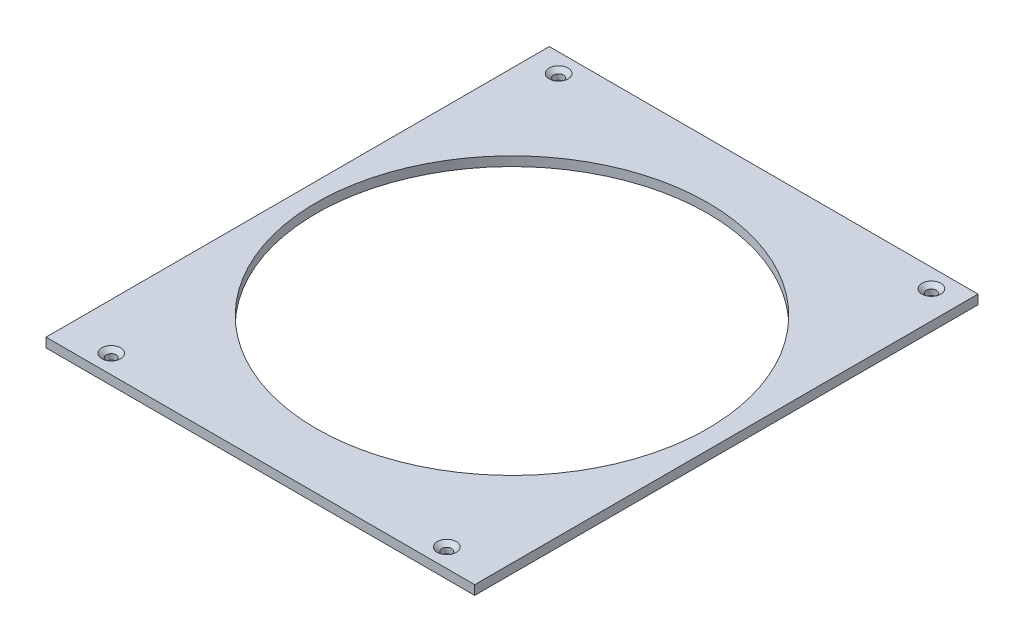
ISO-10303-21;
HEADER;
FILE_DESCRIPTION(('STEP AP214'),'2;1');
FILE_NAME('part.step','',(''),(''),'','','');
FILE_SCHEMA(('AUTOMOTIVE_DESIGN { 1 0 10303 214 1 1 1 1 }'));
ENDSEC;
DATA;
#1=APPLICATION_CONTEXT('core data for automotive mechanical design processes');
#2=APPLICATION_PROTOCOL_DEFINITION('international standard','automotive_design',2000,#1);
#3=PRODUCT_CONTEXT('',#1,'mechanical');
#4=PRODUCT('Part','Part','',(#3));
#5=PRODUCT_RELATED_PRODUCT_CATEGORY('part','',(#4));
#6=PRODUCT_DEFINITION_FORMATION('','',#4);
#7=PRODUCT_DEFINITION_CONTEXT('part definition',#1,'design');
#8=PRODUCT_DEFINITION('design','',#6,#7);
#9=PRODUCT_DEFINITION_SHAPE('','',#8);
#10=(LENGTH_UNIT() NAMED_UNIT(*) SI_UNIT(.MILLI.,.METRE.));
#11=(NAMED_UNIT(*) PLANE_ANGLE_UNIT() SI_UNIT($,.RADIAN.));
#12=(NAMED_UNIT(*) SI_UNIT($,.STERADIAN.) SOLID_ANGLE_UNIT());
#13=UNCERTAINTY_MEASURE_WITH_UNIT(LENGTH_MEASURE(1.E-05),#10,'distance_accuracy_value','');
#14=(GEOMETRIC_REPRESENTATION_CONTEXT(3) GLOBAL_UNCERTAINTY_ASSIGNED_CONTEXT((#13)) GLOBAL_UNIT_ASSIGNED_CONTEXT((#10,
#11,#12)) REPRESENTATION_CONTEXT('',''));
#15=CARTESIAN_POINT('',(0.,0.,0.));
#16=DIRECTION('',(0.,0.,1.));
#17=DIRECTION('',(1.,0.,0.));
#18=AXIS2_PLACEMENT_3D('',#15,#16,#17);
#19=CARTESIAN_POINT('',(0.,6.35,0.));
#20=DIRECTION('',(0.,1.,0.));
#21=DIRECTION('',(0.,0.,1.));
#22=AXIS2_PLACEMENT_3D('',#19,#20,#21);
#23=PLANE('',#22);
#24=CARTESIAN_POINT('',(-114.3,6.35,158.75));
#25=DIRECTION('',(0.,1.,0.));
#26=DIRECTION('',(0.,0.,1.));
#27=AXIS2_PLACEMENT_3D('',#24,#25,#26);
#28=CIRCLE('',#27,6.4389);
#29=CARTESIAN_POINT('',(-114.3,6.35,165.1889));
#30=VERTEX_POINT('',#29);
#31=EDGE_CURVE('E164',#30,#30,#28,.T.);
#32=ORIENTED_EDGE('',*,*,#31,.F.);
#33=EDGE_LOOP('',(#32));
#34=FACE_BOUND('',#33,.T.);
#35=CARTESIAN_POINT('',(114.3,6.35,158.75));
#36=DIRECTION('',(0.,1.,0.));
#37=DIRECTION('',(0.,0.,1.));
#38=AXIS2_PLACEMENT_3D('',#35,#36,#37);
#39=CIRCLE('',#38,6.4389);
#40=CARTESIAN_POINT('',(114.3,6.35,165.1889));
#41=VERTEX_POINT('',#40);
#42=EDGE_CURVE('E155',#41,#41,#39,.T.);
#43=ORIENTED_EDGE('',*,*,#42,.F.);
#44=EDGE_LOOP('',(#43));
#45=FACE_BOUND('',#44,.T.);
#46=CARTESIAN_POINT('',(127.,6.35,-158.75));
#47=DIRECTION('',(0.,1.,0.));
#48=DIRECTION('',(0.,0.,1.));
#49=AXIS2_PLACEMENT_3D('',#46,#47,#48);
#50=CIRCLE('',#49,6.4389);
#51=CARTESIAN_POINT('',(127.,6.35,-152.3111));
#52=VERTEX_POINT('',#51);
#53=EDGE_CURVE('E146',#52,#52,#50,.T.);
#54=ORIENTED_EDGE('',*,*,#53,.F.);
#55=EDGE_LOOP('',(#54));
#56=FACE_BOUND('',#55,.T.);
#57=CARTESIAN_POINT('',(-127.,6.35,-158.75));
#58=DIRECTION('',(0.,1.,0.));
#59=DIRECTION('',(0.,0.,1.));
#60=AXIS2_PLACEMENT_3D('',#57,#58,#59);
#61=CIRCLE('',#60,6.4389);
#62=CARTESIAN_POINT('',(-127.,6.35,-152.3111));
#63=VERTEX_POINT('',#62);
#64=EDGE_CURVE('E137',#63,#63,#61,.T.);
#65=ORIENTED_EDGE('',*,*,#64,.F.);
#66=EDGE_LOOP('',(#65));
#67=FACE_BOUND('',#66,.T.);
#68=DIRECTION('',(-1.,0.,0.));
#69=VECTOR('',#68,1.);
#70=CARTESIAN_POINT('',(0.,6.35,-171.45));
#71=LINE('',#70,#69);
#72=CARTESIAN_POINT('',(146.05,6.35,-171.45));
#73=VERTEX_POINT('',#72);
#74=CARTESIAN_POINT('',(-146.05,6.35,-171.45));
#75=VERTEX_POINT('',#74);
#76=EDGE_CURVE('E92',#73,#75,#71,.T.);
#77=ORIENTED_EDGE('',*,*,#76,.T.);
#78=DIRECTION('',(0.,0.,1.));
#79=VECTOR('',#78,1.);
#80=CARTESIAN_POINT('',(-146.05,6.35,-171.45));
#81=LINE('',#80,#79);
#82=CARTESIAN_POINT('',(-146.05,6.35,171.45));
#83=VERTEX_POINT('',#82);
#84=EDGE_CURVE('E87',#75,#83,#81,.T.);
#85=ORIENTED_EDGE('',*,*,#84,.T.);
#86=DIRECTION('',(1.,0.,0.));
#87=VECTOR('',#86,1.);
#88=CARTESIAN_POINT('',(-146.05,6.35,171.45));
#89=LINE('',#88,#87);
#90=CARTESIAN_POINT('',(146.05,6.35,171.45));
#91=VERTEX_POINT('',#90);
#92=EDGE_CURVE('E90',#83,#91,#89,.T.);
#93=ORIENTED_EDGE('',*,*,#92,.T.);
#94=DIRECTION('',(0.,0.,-1.));
#95=VECTOR('',#94,1.);
#96=CARTESIAN_POINT('',(146.05,6.35,171.45));
#97=LINE('',#96,#95);
#98=EDGE_CURVE('E58',#91,#73,#97,.T.);
#99=ORIENTED_EDGE('',*,*,#98,.T.);
#100=EDGE_LOOP('',(#77,#85,#93,#99));
#101=FACE_BOUND('',#100,.T.);
#102=CARTESIAN_POINT('',(0.,6.35,0.));
#103=DIRECTION('',(0.,1.,0.));
#104=DIRECTION('',(0.,0.,1.));
#105=AXIS2_PLACEMENT_3D('',#102,#103,#104);
#106=CIRCLE('',#105,133.35);
#107=CARTESIAN_POINT('',(0.,6.35,133.35));
#108=VERTEX_POINT('',#107);
#109=EDGE_CURVE('E107',#108,#108,#106,.T.);
#110=ORIENTED_EDGE('',*,*,#109,.F.);
#111=EDGE_LOOP('',(#110));
#112=FACE_BOUND('',#111,.T.);
#113=ADVANCED_FACE('F41',(#34,#45,#56,#67,#101,#112),#23,.T.);
#114=CARTESIAN_POINT('',(0.,0.,0.));
#115=DIRECTION('',(0.,1.,0.));
#116=DIRECTION('',(0.,0.,1.));
#117=AXIS2_PLACEMENT_3D('',#114,#115,#116);
#118=PLANE('',#117);
#119=CARTESIAN_POINT('',(-114.3,0.,158.75));
#120=DIRECTION('',(0.,1.,0.));
#121=DIRECTION('',(0.,0.,1.));
#122=AXIS2_PLACEMENT_3D('',#119,#120,#121);
#123=CIRCLE('',#122,3.3782);
#124=CARTESIAN_POINT('',(-114.3,0.,162.1282));
#125=VERTEX_POINT('',#124);
#126=EDGE_CURVE('E158',#125,#125,#123,.T.);
#127=ORIENTED_EDGE('',*,*,#126,.T.);
#128=EDGE_LOOP('',(#127));
#129=FACE_BOUND('',#128,.T.);
#130=CARTESIAN_POINT('',(114.3,0.,158.75));
#131=DIRECTION('',(0.,1.,0.));
#132=DIRECTION('',(0.,0.,1.));
#133=AXIS2_PLACEMENT_3D('',#130,#131,#132);
#134=CIRCLE('',#133,3.3782);
#135=CARTESIAN_POINT('',(114.3,0.,162.1282));
#136=VERTEX_POINT('',#135);
#137=EDGE_CURVE('E149',#136,#136,#134,.T.);
#138=ORIENTED_EDGE('',*,*,#137,.T.);
#139=EDGE_LOOP('',(#138));
#140=FACE_BOUND('',#139,.T.);
#141=CARTESIAN_POINT('',(127.,0.,-158.75));
#142=DIRECTION('',(0.,1.,0.));
#143=DIRECTION('',(0.,0.,1.));
#144=AXIS2_PLACEMENT_3D('',#141,#142,#143);
#145=CIRCLE('',#144,3.3782);
#146=CARTESIAN_POINT('',(127.,0.,-155.3718));
#147=VERTEX_POINT('',#146);
#148=EDGE_CURVE('E140',#147,#147,#145,.T.);
#149=ORIENTED_EDGE('',*,*,#148,.T.);
#150=EDGE_LOOP('',(#149));
#151=FACE_BOUND('',#150,.T.);
#152=CARTESIAN_POINT('',(-127.,0.,-158.75));
#153=DIRECTION('',(0.,1.,0.));
#154=DIRECTION('',(0.,0.,1.));
#155=AXIS2_PLACEMENT_3D('',#152,#153,#154);
#156=CIRCLE('',#155,3.3782);
#157=CARTESIAN_POINT('',(-127.,0.,-155.3718));
#158=VERTEX_POINT('',#157);
#159=EDGE_CURVE('E126',#158,#158,#156,.T.);
#160=ORIENTED_EDGE('',*,*,#159,.T.);
#161=EDGE_LOOP('',(#160));
#162=FACE_BOUND('',#161,.T.);
#163=DIRECTION('',(0.,0.,1.));
#164=VECTOR('',#163,1.);
#165=CARTESIAN_POINT('',(-146.05,0.,0.));
#166=LINE('',#165,#164);
#167=CARTESIAN_POINT('',(-146.05,0.,-171.45));
#168=VERTEX_POINT('',#167);
#169=CARTESIAN_POINT('',(-146.05,0.,171.45));
#170=VERTEX_POINT('',#169);
#171=EDGE_CURVE('E96',#168,#170,#166,.T.);
#172=ORIENTED_EDGE('',*,*,#171,.F.);
#173=DIRECTION('',(-1.,0.,0.));
#174=VECTOR('',#173,1.);
#175=CARTESIAN_POINT('',(0.,0.,-171.45));
#176=LINE('',#175,#174);
#177=CARTESIAN_POINT('',(146.05,0.,-171.45));
#178=VERTEX_POINT('',#177);
#179=EDGE_CURVE('E110',#178,#168,#176,.T.);
#180=ORIENTED_EDGE('',*,*,#179,.F.);
#181=DIRECTION('',(0.,0.,-1.));
#182=VECTOR('',#181,1.);
#183=CARTESIAN_POINT('',(146.05,0.,0.));
#184=LINE('',#183,#182);
#185=CARTESIAN_POINT('',(146.05,0.,171.45));
#186=VERTEX_POINT('',#185);
#187=EDGE_CURVE('E75',#186,#178,#184,.T.);
#188=ORIENTED_EDGE('',*,*,#187,.F.);
#189=DIRECTION('',(1.,0.,0.));
#190=VECTOR('',#189,1.);
#191=CARTESIAN_POINT('',(-146.05,0.,171.45));
#192=LINE('',#191,#190);
#193=EDGE_CURVE('E106',#170,#186,#192,.T.);
#194=ORIENTED_EDGE('',*,*,#193,.F.);
#195=EDGE_LOOP('',(#172,#180,#188,#194));
#196=FACE_BOUND('',#195,.T.);
#197=CARTESIAN_POINT('',(0.,0.,0.));
#198=DIRECTION('',(0.,1.,0.));
#199=DIRECTION('',(0.,0.,1.));
#200=AXIS2_PLACEMENT_3D('',#197,#198,#199);
#201=CIRCLE('',#200,133.35);
#202=CARTESIAN_POINT('',(0.,0.,133.35));
#203=VERTEX_POINT('',#202);
#204=EDGE_CURVE('E124',#203,#203,#201,.T.);
#205=ORIENTED_EDGE('',*,*,#204,.T.);
#206=EDGE_LOOP('',(#205));
#207=FACE_BOUND('',#206,.T.);
#208=ADVANCED_FACE('F117',(#129,#140,#151,#162,#196,#207),#118,.F.);
#209=CARTESIAN_POINT('',(-146.05,6.35,0.));
#210=DIRECTION('',(1.,0.,0.));
#211=DIRECTION('',(0.,0.,-1.));
#212=AXIS2_PLACEMENT_3D('',#209,#210,#211);
#213=PLANE('',#212);
#214=ORIENTED_EDGE('',*,*,#171,.T.);
#215=DIRECTION('',(0.,-1.,0.));
#216=VECTOR('',#215,1.);
#217=CARTESIAN_POINT('',(-146.05,6.35,171.45));
#218=LINE('',#217,#216);
#219=EDGE_CURVE('E50',#83,#170,#218,.T.);
#220=ORIENTED_EDGE('',*,*,#219,.F.);
#221=ORIENTED_EDGE('',*,*,#84,.F.);
#222=DIRECTION('',(0.,-1.,0.));
#223=VECTOR('',#222,1.);
#224=CARTESIAN_POINT('',(-146.05,6.35,-171.45));
#225=LINE('',#224,#223);
#226=EDGE_CURVE('E12',#75,#168,#225,.T.);
#227=ORIENTED_EDGE('',*,*,#226,.T.);
#228=EDGE_LOOP('',(#214,#220,#221,#227));
#229=FACE_BOUND('',#228,.T.);
#230=ADVANCED_FACE('F43',(#229),#213,.F.);
#231=CARTESIAN_POINT('',(-146.05,6.35,171.45));
#232=DIRECTION('',(0.,0.,-1.));
#233=DIRECTION('',(-1.,0.,0.));
#234=AXIS2_PLACEMENT_3D('',#231,#232,#233);
#235=PLANE('',#234);
#236=ORIENTED_EDGE('',*,*,#193,.T.);
#237=DIRECTION('',(0.,-1.,0.));
#238=VECTOR('',#237,1.);
#239=CARTESIAN_POINT('',(146.05,6.35,171.45));
#240=LINE('',#239,#238);
#241=EDGE_CURVE('E98',#91,#186,#240,.T.);
#242=ORIENTED_EDGE('',*,*,#241,.F.);
#243=ORIENTED_EDGE('',*,*,#92,.F.);
#244=ORIENTED_EDGE('',*,*,#219,.T.);
#245=EDGE_LOOP('',(#236,#242,#243,#244));
#246=FACE_BOUND('',#245,.T.);
#247=ADVANCED_FACE('F99',(#246),#235,.F.);
#248=CARTESIAN_POINT('',(146.05,6.35,0.));
#249=DIRECTION('',(-1.,0.,0.));
#250=DIRECTION('',(0.,0.,1.));
#251=AXIS2_PLACEMENT_3D('',#248,#249,#250);
#252=PLANE('',#251);
#253=ORIENTED_EDGE('',*,*,#187,.T.);
#254=DIRECTION('',(0.,-1.,0.));
#255=VECTOR('',#254,1.);
#256=CARTESIAN_POINT('',(146.05,6.35,-171.45));
#257=LINE('',#256,#255);
#258=EDGE_CURVE('E101',#73,#178,#257,.T.);
#259=ORIENTED_EDGE('',*,*,#258,.F.);
#260=ORIENTED_EDGE('',*,*,#98,.F.);
#261=ORIENTED_EDGE('',*,*,#241,.T.);
#262=EDGE_LOOP('',(#253,#259,#260,#261));
#263=FACE_BOUND('',#262,.T.);
#264=ADVANCED_FACE('F114',(#263),#252,.F.);
#265=CARTESIAN_POINT('',(0.,6.35,-171.45));
#266=DIRECTION('',(0.,0.,1.));
#267=DIRECTION('',(1.,0.,0.));
#268=AXIS2_PLACEMENT_3D('',#265,#266,#267);
#269=PLANE('',#268);
#270=ORIENTED_EDGE('',*,*,#179,.T.);
#271=ORIENTED_EDGE('',*,*,#226,.F.);
#272=ORIENTED_EDGE('',*,*,#76,.F.);
#273=ORIENTED_EDGE('',*,*,#258,.T.);
#274=EDGE_LOOP('',(#270,#271,#272,#273));
#275=FACE_BOUND('',#274,.T.);
#276=ADVANCED_FACE('F116',(#275),#269,.F.);
#277=CARTESIAN_POINT('',(0.,6.35,0.));
#278=DIRECTION('',(0.,-1.,0.));
#279=DIRECTION('',(0.,0.,-1.));
#280=AXIS2_PLACEMENT_3D('',#277,#278,#279);
#281=CYLINDRICAL_SURFACE('',#280,133.35);
#282=ORIENTED_EDGE('',*,*,#109,.T.);
#283=EDGE_LOOP('',(#282));
#284=FACE_BOUND('',#283,.T.);
#285=ORIENTED_EDGE('',*,*,#204,.F.);
#286=EDGE_LOOP('',(#285));
#287=FACE_BOUND('',#286,.T.);
#288=ADVANCED_FACE('F192',(#284,#287),#281,.F.);
#289=CARTESIAN_POINT('',(-127.,6.35,-158.75));
#290=DIRECTION('',(0.,1.,0.));
#291=DIRECTION('',(0.,0.,1.));
#292=AXIS2_PLACEMENT_3D('',#289,#290,#291);
#293=CYLINDRICAL_SURFACE('',#292,3.3782);
#294=ORIENTED_EDGE('',*,*,#159,.F.);
#295=EDGE_LOOP('',(#294));
#296=FACE_BOUND('',#295,.T.);
#297=CARTESIAN_POINT('',(-127.,3.7817677588557,-158.75));
#298=DIRECTION('',(0.,1.,0.));
#299=DIRECTION('',(0.,0.,1.));
#300=AXIS2_PLACEMENT_3D('',#297,#298,#299);
#301=CIRCLE('',#300,3.3782);
#302=CARTESIAN_POINT('',(-127.,3.7817677588557,-155.3718));
#303=VERTEX_POINT('',#302);
#304=EDGE_CURVE('E130',#303,#303,#301,.T.);
#305=ORIENTED_EDGE('',*,*,#304,.T.);
#306=EDGE_LOOP('',(#305));
#307=FACE_BOUND('',#306,.T.);
#308=ADVANCED_FACE('F182',(#296,#307),#293,.F.);
#309=CARTESIAN_POINT('',(-127.,6.35,-158.75));
#310=DIRECTION('',(0.,1.,0.));
#311=DIRECTION('',(0.,0.,1.));
#312=AXIS2_PLACEMENT_3D('',#309,#310,#311);
#313=CONICAL_SURFACE('',#312,6.4389,0.872664625997164);
#314=ORIENTED_EDGE('',*,*,#304,.F.);
#315=EDGE_LOOP('',(#314));
#316=FACE_BOUND('',#315,.T.);
#317=ORIENTED_EDGE('',*,*,#64,.T.);
#318=EDGE_LOOP('',(#317));
#319=FACE_BOUND('',#318,.T.);
#320=ADVANCED_FACE('F179',(#316,#319),#313,.F.);
#321=CARTESIAN_POINT('',(127.,6.35,-158.75));
#322=DIRECTION('',(0.,1.,0.));
#323=DIRECTION('',(0.,0.,1.));
#324=AXIS2_PLACEMENT_3D('',#321,#322,#323);
#325=CYLINDRICAL_SURFACE('',#324,3.3782);
#326=ORIENTED_EDGE('',*,*,#148,.F.);
#327=EDGE_LOOP('',(#326));
#328=FACE_BOUND('',#327,.T.);
#329=CARTESIAN_POINT('',(127.,3.7817677588557,-158.75));
#330=DIRECTION('',(0.,1.,0.));
#331=DIRECTION('',(0.,0.,1.));
#332=AXIS2_PLACEMENT_3D('',#329,#330,#331);
#333=CIRCLE('',#332,3.3782);
#334=CARTESIAN_POINT('',(127.,3.7817677588557,-155.3718));
#335=VERTEX_POINT('',#334);
#336=EDGE_CURVE('E143',#335,#335,#333,.T.);
#337=ORIENTED_EDGE('',*,*,#336,.T.);
#338=EDGE_LOOP('',(#337));
#339=FACE_BOUND('',#338,.T.);
#340=ADVANCED_FACE('F181',(#328,#339),#325,.F.);
#341=CARTESIAN_POINT('',(127.,6.35,-158.75));
#342=DIRECTION('',(0.,1.,0.));
#343=DIRECTION('',(0.,0.,1.));
#344=AXIS2_PLACEMENT_3D('',#341,#342,#343);
#345=CONICAL_SURFACE('',#344,6.4389,0.872664625997164);
#346=ORIENTED_EDGE('',*,*,#336,.F.);
#347=EDGE_LOOP('',(#346));
#348=FACE_BOUND('',#347,.T.);
#349=ORIENTED_EDGE('',*,*,#53,.T.);
#350=EDGE_LOOP('',(#349));
#351=FACE_BOUND('',#350,.T.);
#352=ADVANCED_FACE('F189',(#348,#351),#345,.F.);
#353=CARTESIAN_POINT('',(114.3,6.35,158.75));
#354=DIRECTION('',(0.,1.,0.));
#355=DIRECTION('',(0.,0.,1.));
#356=AXIS2_PLACEMENT_3D('',#353,#354,#355);
#357=CYLINDRICAL_SURFACE('',#356,3.3782);
#358=ORIENTED_EDGE('',*,*,#137,.F.);
#359=EDGE_LOOP('',(#358));
#360=FACE_BOUND('',#359,.T.);
#361=CARTESIAN_POINT('',(114.3,3.7817677588557,158.75));
#362=DIRECTION('',(0.,1.,0.));
#363=DIRECTION('',(0.,0.,1.));
#364=AXIS2_PLACEMENT_3D('',#361,#362,#363);
#365=CIRCLE('',#364,3.3782);
#366=CARTESIAN_POINT('',(114.3,3.7817677588557,162.1282));
#367=VERTEX_POINT('',#366);
#368=EDGE_CURVE('E152',#367,#367,#365,.T.);
#369=ORIENTED_EDGE('',*,*,#368,.T.);
#370=EDGE_LOOP('',(#369));
#371=FACE_BOUND('',#370,.T.);
#372=ADVANCED_FACE('F278',(#360,#371),#357,.F.);
#373=CARTESIAN_POINT('',(114.3,6.35,158.75));
#374=DIRECTION('',(0.,1.,0.));
#375=DIRECTION('',(0.,0.,1.));
#376=AXIS2_PLACEMENT_3D('',#373,#374,#375);
#377=CONICAL_SURFACE('',#376,6.4389,0.872664625997164);
#378=ORIENTED_EDGE('',*,*,#368,.F.);
#379=EDGE_LOOP('',(#378));
#380=FACE_BOUND('',#379,.T.);
#381=ORIENTED_EDGE('',*,*,#42,.T.);
#382=EDGE_LOOP('',(#381));
#383=FACE_BOUND('',#382,.T.);
#384=ADVANCED_FACE('F287',(#380,#383),#377,.F.);
#385=CARTESIAN_POINT('',(-114.3,6.35,158.75));
#386=DIRECTION('',(0.,1.,0.));
#387=DIRECTION('',(0.,0.,1.));
#388=AXIS2_PLACEMENT_3D('',#385,#386,#387);
#389=CYLINDRICAL_SURFACE('',#388,3.3782);
#390=ORIENTED_EDGE('',*,*,#126,.F.);
#391=EDGE_LOOP('',(#390));
#392=FACE_BOUND('',#391,.T.);
#393=CARTESIAN_POINT('',(-114.3,3.7817677588557,158.75));
#394=DIRECTION('',(0.,1.,0.));
#395=DIRECTION('',(0.,0.,1.));
#396=AXIS2_PLACEMENT_3D('',#393,#394,#395);
#397=CIRCLE('',#396,3.3782);
#398=CARTESIAN_POINT('',(-114.3,3.7817677588557,162.1282));
#399=VERTEX_POINT('',#398);
#400=EDGE_CURVE('E161',#399,#399,#397,.T.);
#401=ORIENTED_EDGE('',*,*,#400,.T.);
#402=EDGE_LOOP('',(#401));
#403=FACE_BOUND('',#402,.T.);
#404=ADVANCED_FACE('F297',(#392,#403),#389,.F.);
#405=CARTESIAN_POINT('',(-114.3,6.35,158.75));
#406=DIRECTION('',(0.,1.,0.));
#407=DIRECTION('',(0.,0.,1.));
#408=AXIS2_PLACEMENT_3D('',#405,#406,#407);
#409=CONICAL_SURFACE('',#408,6.4389,0.872664625997164);
#410=ORIENTED_EDGE('',*,*,#400,.F.);
#411=EDGE_LOOP('',(#410));
#412=FACE_BOUND('',#411,.T.);
#413=ORIENTED_EDGE('',*,*,#31,.T.);
#414=EDGE_LOOP('',(#413));
#415=FACE_BOUND('',#414,.T.);
#416=ADVANCED_FACE('F168',(#412,#415),#409,.F.);
#417=CLOSED_SHELL('',(#113,#208,#230,#247,#264,#276,#288,#308,#320,#340,#352,#372,#384,#404,#416));
#418=MANIFOLD_SOLID_BREP('B2',#417);
#419=ADVANCED_BREP_SHAPE_REPRESENTATION('',(#18,#418),#14);
#420=SHAPE_DEFINITION_REPRESENTATION(#9,#419);
ENDSEC;
END-ISO-10303-21;
